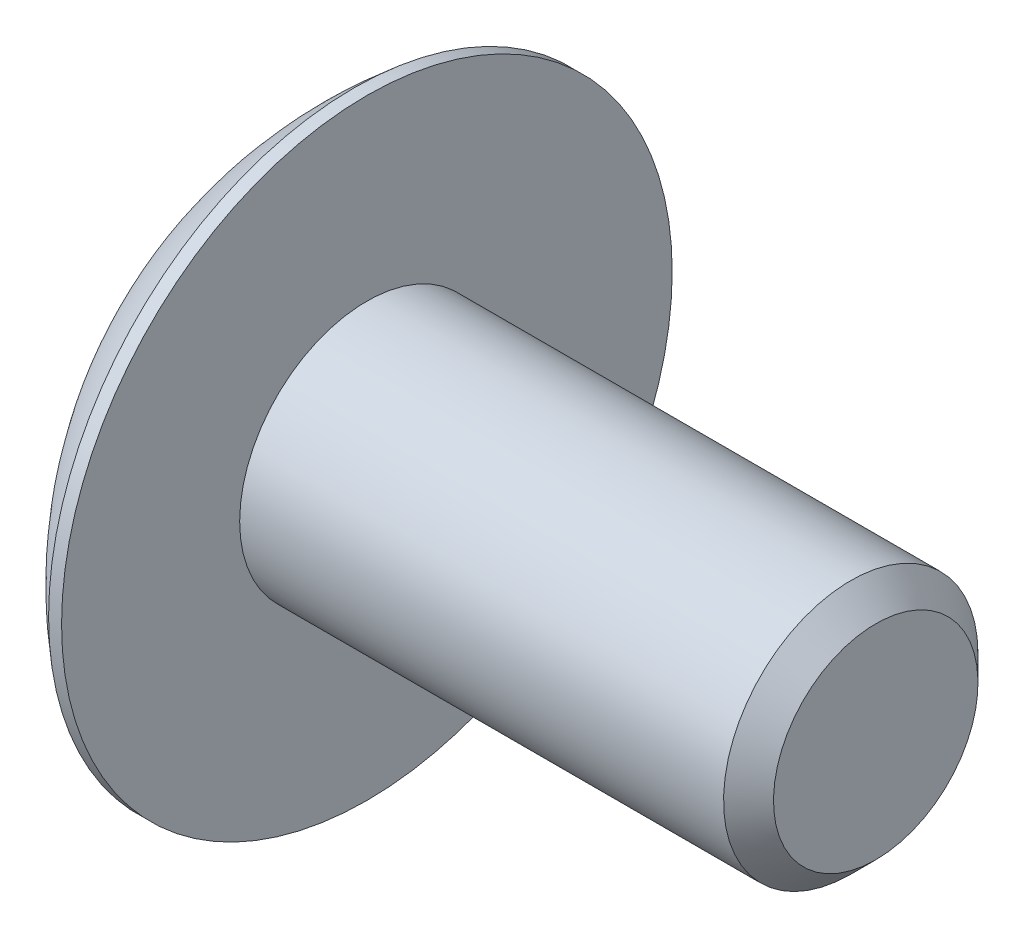
ISO-10303-21;
HEADER;
FILE_DESCRIPTION(('STEP AP214'),'2;1');
FILE_NAME('part.step','',(''),(''),'','','');
FILE_SCHEMA(('AUTOMOTIVE_DESIGN { 1 0 10303 214 1 1 1 1 }'));
ENDSEC;
DATA;
#1=APPLICATION_CONTEXT('core data for automotive mechanical design processes');
#2=APPLICATION_PROTOCOL_DEFINITION('international standard','automotive_design',2000,#1);
#3=PRODUCT_CONTEXT('',#1,'mechanical');
#4=PRODUCT('Part','Part','',(#3));
#5=PRODUCT_RELATED_PRODUCT_CATEGORY('part','',(#4));
#6=PRODUCT_DEFINITION_FORMATION('','',#4);
#7=PRODUCT_DEFINITION_CONTEXT('part definition',#1,'design');
#8=PRODUCT_DEFINITION('design','',#6,#7);
#9=PRODUCT_DEFINITION_SHAPE('','',#8);
#10=(LENGTH_UNIT() NAMED_UNIT(*) SI_UNIT(.MILLI.,.METRE.));
#11=(NAMED_UNIT(*) PLANE_ANGLE_UNIT() SI_UNIT($,.RADIAN.));
#12=(NAMED_UNIT(*) SI_UNIT($,.STERADIAN.) SOLID_ANGLE_UNIT());
#13=UNCERTAINTY_MEASURE_WITH_UNIT(LENGTH_MEASURE(1.E-05),#10,'distance_accuracy_value','');
#14=(GEOMETRIC_REPRESENTATION_CONTEXT(3) GLOBAL_UNCERTAINTY_ASSIGNED_CONTEXT((#13)) GLOBAL_UNIT_ASSIGNED_CONTEXT((#10,
#11,#12)) REPRESENTATION_CONTEXT('',''));
#15=CARTESIAN_POINT('',(0.,0.,0.));
#16=DIRECTION('',(0.,0.,1.));
#17=DIRECTION('',(1.,0.,0.));
#18=AXIS2_PLACEMENT_3D('',#15,#16,#17);
#19=CARTESIAN_POINT('',(10.,-2.033614,2.033614));
#20=DIRECTION('',(1.,0.,0.));
#21=DIRECTION('',(0.,0.,-1.));
#22=AXIS2_PLACEMENT_3D('',#19,#20,#21);
#23=PLANE('',#22);
#24=CARTESIAN_POINT('',(10.,0.,0.));
#25=DIRECTION('',(-1.,0.,0.));
#26=DIRECTION('',(0.,-1.,0.));
#27=AXIS2_PLACEMENT_3D('',#24,#25,#26);
#28=CIRCLE('',#27,2.0095);
#29=CARTESIAN_POINT('',(10.,-2.0095,0.));
#30=VERTEX_POINT('',#29);
#31=EDGE_CURVE('E18',#30,#30,#28,.T.);
#32=ORIENTED_EDGE('',*,*,#31,.F.);
#33=EDGE_LOOP('',(#32));
#34=FACE_BOUND('',#33,.T.);
#35=ADVANCED_FACE('F15',(#34),#23,.T.);
#36=CARTESIAN_POINT('',(10.,0.,0.));
#37=DIRECTION('',(-1.,0.,0.));
#38=DIRECTION('',(0.,-1.,0.));
#39=AXIS2_PLACEMENT_3D('',#36,#37,#38);
#40=CONICAL_SURFACE('',#39,2.0095,0.785398163397449);
#41=CARTESIAN_POINT('',(9.5095,0.,0.));
#42=DIRECTION('',(1.,0.,0.));
#43=DIRECTION('',(0.,0.,-1.));
#44=AXIS2_PLACEMENT_3D('',#41,#42,#43);
#45=CIRCLE('',#44,2.5);
#46=CARTESIAN_POINT('',(9.5095,0.,-2.5));
#47=VERTEX_POINT('',#46);
#48=EDGE_CURVE('E165',#47,#47,#45,.F.);
#49=ORIENTED_EDGE('',*,*,#48,.F.);
#50=EDGE_LOOP('',(#49));
#51=FACE_BOUND('',#50,.T.);
#52=ORIENTED_EDGE('',*,*,#31,.T.);
#53=EDGE_LOOP('',(#52));
#54=FACE_BOUND('',#53,.T.);
#55=ADVANCED_FACE('F295',(#51,#54),#40,.T.);
#56=CARTESIAN_POINT('',(9.5095,0.,0.));
#57=DIRECTION('',(1.,0.,0.));
#58=DIRECTION('',(0.,0.,-1.));
#59=AXIS2_PLACEMENT_3D('',#56,#57,#58);
#60=CYLINDRICAL_SURFACE('',#59,2.5);
#61=ORIENTED_EDGE('',*,*,#48,.T.);
#62=EDGE_LOOP('',(#61));
#63=FACE_BOUND('',#62,.T.);
#64=CARTESIAN_POINT('',(0.,0.,0.));
#65=DIRECTION('',(1.,0.,0.));
#66=DIRECTION('',(0.,0.,-1.));
#67=AXIS2_PLACEMENT_3D('',#64,#65,#66);
#68=CIRCLE('',#67,2.5);
#69=CARTESIAN_POINT('',(0.,0.,-2.5));
#70=VERTEX_POINT('',#69);
#71=EDGE_CURVE('E118',#70,#70,#68,.F.);
#72=ORIENTED_EDGE('',*,*,#71,.F.);
#73=EDGE_LOOP('',(#72));
#74=FACE_BOUND('',#73,.T.);
#75=ADVANCED_FACE('F292',(#63,#74),#60,.T.);
#76=CARTESIAN_POINT('',(0.,-6.07200000000001,6.072));
#77=DIRECTION('',(1.,0.,0.));
#78=DIRECTION('',(0.,0.,-1.));
#79=AXIS2_PLACEMENT_3D('',#76,#77,#78);
#80=PLANE('',#79);
#81=ORIENTED_EDGE('',*,*,#71,.T.);
#82=EDGE_LOOP('',(#81));
#83=FACE_BOUND('',#82,.T.);
#84=CARTESIAN_POINT('',(0.,0.,0.));
#85=DIRECTION('',(1.,0.,0.));
#86=DIRECTION('',(0.,0.,-1.));
#87=AXIS2_PLACEMENT_3D('',#84,#85,#86);
#88=CIRCLE('',#87,6.);
#89=CARTESIAN_POINT('',(0.,0.,-6.));
#90=VERTEX_POINT('',#89);
#91=EDGE_CURVE('E117',#90,#90,#88,.F.);
#92=ORIENTED_EDGE('',*,*,#91,.F.);
#93=EDGE_LOOP('',(#92));
#94=FACE_BOUND('',#93,.T.);
#95=ADVANCED_FACE('F289',(#83,#94),#80,.T.);
#96=CARTESIAN_POINT('',(-1.55,-2.48,-2.48));
#97=DIRECTION('',(-1.,0.,0.));
#98=DIRECTION('',(0.,0.,1.));
#99=AXIS2_PLACEMENT_3D('',#96,#97,#98);
#100=PLANE('',#99);
#101=DIRECTION('',(0.,0.,-1.));
#102=VECTOR('',#101,1.);
#103=CARTESIAN_POINT('',(-1.55,-0.62,1.55));
#104=LINE('',#103,#102);
#105=CARTESIAN_POINT('',(-1.55,-0.62,2.48));
#106=VERTEX_POINT('',#105);
#107=CARTESIAN_POINT('',(-1.55,-0.62,0.62));
#108=VERTEX_POINT('',#107);
#109=EDGE_CURVE('E155',#106,#108,#104,.T.);
#110=ORIENTED_EDGE('',*,*,#109,.F.);
#111=DIRECTION('',(0.,1.,0.));
#112=VECTOR('',#111,1.);
#113=CARTESIAN_POINT('',(-1.55,-0.62,2.48));
#114=LINE('',#113,#112);
#115=CARTESIAN_POINT('',(-1.55,0.62,2.48));
#116=VERTEX_POINT('',#115);
#117=EDGE_CURVE('E158',#116,#106,#114,.F.);
#118=ORIENTED_EDGE('',*,*,#117,.F.);
#119=DIRECTION('',(0.,0.,1.));
#120=VECTOR('',#119,1.);
#121=CARTESIAN_POINT('',(-1.55,0.62,1.55));
#122=LINE('',#121,#120);
#123=CARTESIAN_POINT('',(-1.55,0.62,0.62));
#124=VERTEX_POINT('',#123);
#125=EDGE_CURVE('E161',#124,#116,#122,.T.);
#126=ORIENTED_EDGE('',*,*,#125,.F.);
#127=DIRECTION('',(0.,1.,0.));
#128=VECTOR('',#127,1.);
#129=CARTESIAN_POINT('',(-1.55,0.62,0.62));
#130=LINE('',#129,#128);
#131=CARTESIAN_POINT('',(-1.55,2.48,0.62));
#132=VERTEX_POINT('',#131);
#133=EDGE_CURVE('E125',#132,#124,#130,.F.);
#134=ORIENTED_EDGE('',*,*,#133,.F.);
#135=DIRECTION('',(0.,0.,1.));
#136=VECTOR('',#135,1.);
#137=CARTESIAN_POINT('',(-1.55,2.48,0.));
#138=LINE('',#137,#136);
#139=CARTESIAN_POINT('',(-1.55,2.48,-0.62));
#140=VERTEX_POINT('',#139);
#141=EDGE_CURVE('E121',#140,#132,#138,.T.);
#142=ORIENTED_EDGE('',*,*,#141,.F.);
#143=DIRECTION('',(0.,1.,0.));
#144=VECTOR('',#143,1.);
#145=CARTESIAN_POINT('',(-1.55,0.62,-0.62));
#146=LINE('',#145,#144);
#147=CARTESIAN_POINT('',(-1.55,0.62,-0.62));
#148=VERTEX_POINT('',#147);
#149=EDGE_CURVE('E78',#148,#140,#146,.T.);
#150=ORIENTED_EDGE('',*,*,#149,.F.);
#151=DIRECTION('',(0.,0.,1.));
#152=VECTOR('',#151,1.);
#153=CARTESIAN_POINT('',(-1.55,0.62,-1.55));
#154=LINE('',#153,#152);
#155=CARTESIAN_POINT('',(-1.55,0.62,-2.48));
#156=VERTEX_POINT('',#155);
#157=EDGE_CURVE('E139',#156,#148,#154,.T.);
#158=ORIENTED_EDGE('',*,*,#157,.F.);
#159=DIRECTION('',(0.,1.,0.));
#160=VECTOR('',#159,1.);
#161=CARTESIAN_POINT('',(-1.55,-0.62,-2.48));
#162=LINE('',#161,#160);
#163=CARTESIAN_POINT('',(-1.55,-0.62,-2.48));
#164=VERTEX_POINT('',#163);
#165=EDGE_CURVE('E83',#164,#156,#162,.T.);
#166=ORIENTED_EDGE('',*,*,#165,.F.);
#167=DIRECTION('',(0.,0.,-1.));
#168=VECTOR('',#167,1.);
#169=CARTESIAN_POINT('',(-1.55,-0.62,-1.55));
#170=LINE('',#169,#168);
#171=CARTESIAN_POINT('',(-1.55,-0.62,-0.62));
#172=VERTEX_POINT('',#171);
#173=EDGE_CURVE('E143',#172,#164,#170,.T.);
#174=ORIENTED_EDGE('',*,*,#173,.F.);
#175=DIRECTION('',(0.,1.,0.));
#176=VECTOR('',#175,1.);
#177=CARTESIAN_POINT('',(-1.55,-2.48,-0.62));
#178=LINE('',#177,#176);
#179=CARTESIAN_POINT('',(-1.55,-2.48,-0.62));
#180=VERTEX_POINT('',#179);
#181=EDGE_CURVE('E146',#180,#172,#178,.T.);
#182=ORIENTED_EDGE('',*,*,#181,.F.);
#183=DIRECTION('',(0.,0.,-1.));
#184=VECTOR('',#183,1.);
#185=CARTESIAN_POINT('',(-1.55,-2.48,0.));
#186=LINE('',#185,#184);
#187=CARTESIAN_POINT('',(-1.55,-2.48,0.62));
#188=VERTEX_POINT('',#187);
#189=EDGE_CURVE('E149',#188,#180,#186,.T.);
#190=ORIENTED_EDGE('',*,*,#189,.F.);
#191=DIRECTION('',(0.,1.,0.));
#192=VECTOR('',#191,1.);
#193=CARTESIAN_POINT('',(-1.55,-2.48,0.62));
#194=LINE('',#193,#192);
#195=EDGE_CURVE('E152',#108,#188,#194,.F.);
#196=ORIENTED_EDGE('',*,*,#195,.F.);
#197=EDGE_LOOP('',(#110,#118,#126,#134,#142,#150,#158,#166,#174,#182,#190,#196));
#198=FACE_BOUND('',#197,.T.);
#199=ADVANCED_FACE('F123',(#198),#100,.T.);
#200=CARTESIAN_POINT('',(-3.05924169752797,0.62,-0.62));
#201=DIRECTION('',(0.,0.,1.));
#202=DIRECTION('',(1.,0.,0.));
#203=AXIS2_PLACEMENT_3D('',#200,#201,#202);
#204=PLANE('',#203);
#205=DIRECTION('',(1.,0.,0.));
#206=VECTOR('',#205,1.);
#207=CARTESIAN_POINT('',(-2.699340870773,2.48,-0.62));
#208=LINE('',#207,#206);
#209=CARTESIAN_POINT('',(-2.66626270714769,2.48,-0.620000000000003));
#210=VERTEX_POINT('',#209);
#211=EDGE_CURVE('E113',#210,#140,#208,.T.);
#212=ORIENTED_EDGE('',*,*,#211,.F.);
#213=CARTESIAN_POINT('',(-3.05024025599203,0.620000000000015,-0.620000000000001));
#214=CARTESIAN_POINT('',(-3.03976785253531,0.750042430570017,-0.620000000000001));
#215=CARTESIAN_POINT('',(-3.02600570245601,0.879791187471085,-0.62));
#216=CARTESIAN_POINT('',(-2.99192929742701,1.13844253143422,-0.62));
#217=CARTESIAN_POINT('',(-2.97161419096447,1.26734500630525,-0.62));
#218=CARTESIAN_POINT('',(-2.90119534299645,1.65065962618764,-0.62));
#219=CARTESIAN_POINT('',(-2.84147927553657,1.90339315228961,-0.62));
#220=CARTESIAN_POINT('',(-2.73735262943617,2.2623658375459,-0.62));
#221=CARTESIAN_POINT('',(-2.70301225175608,2.37161122534369,-0.62));
#222=CARTESIAN_POINT('',(-2.66626270714769,2.48000000000001,-0.62));
#223=B_SPLINE_CURVE_WITH_KNOTS('',3,(#213,#214,#215,#216,#217,#218,#219,#220,#221,#222),
.UNSPECIFIED.,.F.,.F.,(4,2,2,2,4),(0.,0.391291116744801,0.782633099649313,1.56018065414437,
1.90359581219608),.UNSPECIFIED.);
#224=CARTESIAN_POINT('',(-3.05024025599202,0.620000000000008,-0.620000000000001));
#225=VERTEX_POINT('',#224);
#226=EDGE_CURVE('E70',#225,#210,#223,.T.);
#227=ORIENTED_EDGE('',*,*,#226,.F.);
#228=DIRECTION('',(1.,0.,0.));
#229=VECTOR('',#228,1.);
#230=CARTESIAN_POINT('',(-3.05924169752797,0.62,-0.62));
#231=LINE('',#230,#229);
#232=EDGE_CURVE('E115',#148,#225,#231,.F.);
#233=ORIENTED_EDGE('',*,*,#232,.F.);
#234=ORIENTED_EDGE('',*,*,#149,.T.);
#235=EDGE_LOOP('',(#212,#227,#233,#234));
#236=FACE_BOUND('',#235,.T.);
#237=ADVANCED_FACE('F111',(#236),#204,.T.);
#238=CARTESIAN_POINT('',(0.,0.,0.));
#239=DIRECTION('',(1.,0.,0.));
#240=DIRECTION('',(0.,0.,-1.));
#241=AXIS2_PLACEMENT_3D('',#238,#239,#240);
#242=CYLINDRICAL_SURFACE('',#241,6.);
#243=ORIENTED_EDGE('',*,*,#91,.T.);
#244=EDGE_LOOP('',(#243));
#245=FACE_BOUND('',#244,.T.);
#246=CARTESIAN_POINT('',(-0.25535421758717,0.,0.));
#247=DIRECTION('',(1.,0.,0.));
#248=DIRECTION('',(0.,1.,0.));
#249=AXIS2_PLACEMENT_3D('',#246,#247,#248);
#250=CIRCLE('',#249,5.99999999999999);
#251=CARTESIAN_POINT('',(-0.25535421758717,5.99999999999999,0.));
#252=VERTEX_POINT('',#251);
#253=EDGE_CURVE('E280',#252,#252,#250,.F.);
#254=ORIENTED_EDGE('',*,*,#253,.F.);
#255=EDGE_LOOP('',(#254));
#256=FACE_BOUND('',#255,.T.);
#257=ADVANCED_FACE('F274',(#245,#256),#242,.T.);
#258=CARTESIAN_POINT('',(-2.699340870773,2.48,0.62));
#259=DIRECTION('',(0.,-1.,0.));
#260=DIRECTION('',(0.,0.,-1.));
#261=AXIS2_PLACEMENT_3D('',#258,#259,#260);
#262=PLANE('',#261);
#263=DIRECTION('',(1.,0.,0.));
#264=VECTOR('',#263,1.);
#265=CARTESIAN_POINT('',(-2.30462084876399,2.48,0.62));
#266=LINE('',#265,#264);
#267=CARTESIAN_POINT('',(-2.66626270714769,2.48000000000001,0.62));
#268=VERTEX_POINT('',#267);
#269=EDGE_CURVE('E129',#268,#132,#266,.T.);
#270=ORIENTED_EDGE('',*,*,#269,.F.);
#271=CARTESIAN_POINT('',(-2.6662627071477,2.48,-0.620000000000006));
#272=CARTESIAN_POINT('',(-2.68374487241107,2.48,-0.413333333333334));
#273=CARTESIAN_POINT('',(-2.69248595504276,2.48,-0.206666666666663));
#274=CARTESIAN_POINT('',(-2.69248595504276,2.48,0.206666666666672));
#275=CARTESIAN_POINT('',(-2.68374487241107,2.48,0.413333333333335));
#276=CARTESIAN_POINT('',(-2.6662627071477,2.48,0.619999999999998));
#277=B_SPLINE_CURVE_WITH_KNOTS('',3,(#271,#272,#273,#274,#275,#276),.UNSPECIFIED.,.F.,.F.,(4,2,
4),(0.,0.620554315697009,1.24110863139399),.UNSPECIFIED.);
#278=EDGE_CURVE('E132',#210,#268,#277,.T.);
#279=ORIENTED_EDGE('',*,*,#278,.F.);
#280=ORIENTED_EDGE('',*,*,#211,.T.);
#281=ORIENTED_EDGE('',*,*,#141,.T.);
#282=EDGE_LOOP('',(#270,#279,#280,#281));
#283=FACE_BOUND('',#282,.T.);
#284=ADVANCED_FACE('F131',(#283),#262,.T.);
#285=CARTESIAN_POINT('',(-1.55,0.62,0.62));
#286=DIRECTION('',(0.,0.,-1.));
#287=DIRECTION('',(-1.,0.,0.));
#288=AXIS2_PLACEMENT_3D('',#285,#286,#287);
#289=PLANE('',#288);
#290=DIRECTION('',(1.,0.,0.));
#291=VECTOR('',#290,1.);
#292=CARTESIAN_POINT('',(-3.05924169752797,0.62,0.62));
#293=LINE('',#292,#291);
#294=CARTESIAN_POINT('',(-3.05024025599202,0.620000000000001,0.620000000000008));
#295=VERTEX_POINT('',#294);
#296=EDGE_CURVE('E163',#295,#124,#293,.T.);
#297=ORIENTED_EDGE('',*,*,#296,.F.);
#298=CARTESIAN_POINT('',(-2.66626270714769,2.48000000000002,0.62));
#299=CARTESIAN_POINT('',(-2.69181640713699,2.40461518803386,0.62));
#300=CARTESIAN_POINT('',(-2.71620419200081,2.32883520125785,0.62));
#301=CARTESIAN_POINT('',(-2.76256054766245,2.17677383977463,0.62));
#302=CARTESIAN_POINT('',(-2.78453578607209,2.10049449766565,0.62));
#303=CARTESIAN_POINT('',(-2.82608557115019,1.94743963746694,0.62));
#304=CARTESIAN_POINT('',(-2.84566457906741,1.870665330453,0.62));
#305=CARTESIAN_POINT('',(-2.88243428856193,1.71662395682747,0.62));
#306=CARTESIAN_POINT('',(-2.8996272398254,1.63935742720947,0.62));
#307=CARTESIAN_POINT('',(-2.93163051496762,1.48433249946647,0.62));
#308=CARTESIAN_POINT('',(-2.94644083884637,1.40657410134147,0.62));
#309=CARTESIAN_POINT('',(-2.97367784849535,1.2505648015221,0.62));
#310=CARTESIAN_POINT('',(-2.98610225584174,1.17231350204033,0.62));
#311=CARTESIAN_POINT('',(-3.0085593020508,1.01531714556654,0.62));
#312=CARTESIAN_POINT('',(-3.0185873647853,0.936571433978338,0.62));
#313=CARTESIAN_POINT('',(-3.03623735234413,0.778583943000307,0.62));
#314=CARTESIAN_POINT('',(-3.04385234972373,0.69934138965147,0.62));
#315=CARTESIAN_POINT('',(-3.05024025599203,0.620000000000012,0.619999999999999));
#316=B_SPLINE_CURVE_WITH_KNOTS('',3,(#298,#299,#300,#301,#302,#303,#304,#305,#306,#307,#308,
#309,#310,#311,#312,#313,#314,#315),.UNSPECIFIED.,.F.,.F.,(4,2,2,2,2,2,2,2,4),(0.,
0.238784796436356,0.476892098817798,0.714549127805248,0.951980537755309,1.18941194770537,
1.42706897669282,1.66517627907426,1.90396107551062),.UNSPECIFIED.);
#317=EDGE_CURVE('E256',#268,#295,#316,.T.);
#318=ORIENTED_EDGE('',*,*,#317,.F.);
#319=ORIENTED_EDGE('',*,*,#269,.T.);
#320=ORIENTED_EDGE('',*,*,#133,.T.);
#321=EDGE_LOOP('',(#297,#318,#319,#320));
#322=FACE_BOUND('',#321,.T.);
#323=ADVANCED_FACE('F265',(#322),#289,.T.);
#324=CARTESIAN_POINT('',(-3.05924169752797,0.62,2.48));
#325=DIRECTION('',(0.,-1.,0.));
#326=DIRECTION('',(0.,0.,-1.));
#327=AXIS2_PLACEMENT_3D('',#324,#325,#326);
#328=PLANE('',#327);
#329=DIRECTION('',(1.,0.,0.));
#330=VECTOR('',#329,1.);
#331=CARTESIAN_POINT('',(-2.12467043538651,0.62,2.48));
#332=LINE('',#331,#330);
#333=CARTESIAN_POINT('',(-2.66626270714769,0.620000000000004,2.48));
#334=VERTEX_POINT('',#333);
#335=EDGE_CURVE('E160',#334,#116,#332,.T.);
#336=ORIENTED_EDGE('',*,*,#335,.F.);
#337=CARTESIAN_POINT('',(-3.05024025599203,0.620000000000001,0.620000000000015));
#338=CARTESIAN_POINT('',(-3.03976785253531,0.620000000000001,0.750042430570017));
#339=CARTESIAN_POINT('',(-3.02600570245601,0.62,0.879791187471085));
#340=CARTESIAN_POINT('',(-2.99192929742701,0.62,1.13844253143422));
#341=CARTESIAN_POINT('',(-2.97161419096447,0.62,1.26734500630525));
#342=CARTESIAN_POINT('',(-2.90119534299645,0.62,1.65065962618764));
#343=CARTESIAN_POINT('',(-2.84147927553657,0.62,1.90339315228961));
#344=CARTESIAN_POINT('',(-2.73735262943617,0.62,2.2623658375459));
#345=CARTESIAN_POINT('',(-2.70301225175608,0.62,2.37161122534369));
#346=CARTESIAN_POINT('',(-2.66626270714769,0.62,2.48000000000001));
#347=B_SPLINE_CURVE_WITH_KNOTS('',3,(#337,#338,#339,#340,#341,#342,#343,#344,#345,#346),
.UNSPECIFIED.,.F.,.F.,(4,2,2,2,4),(0.,0.391291116744801,0.782633099649313,1.56018065414437,
1.90359581219608),.UNSPECIFIED.);
#348=EDGE_CURVE('E250',#295,#334,#347,.T.);
#349=ORIENTED_EDGE('',*,*,#348,.F.);
#350=ORIENTED_EDGE('',*,*,#296,.T.);
#351=ORIENTED_EDGE('',*,*,#125,.T.);
#352=EDGE_LOOP('',(#336,#349,#350,#351));
#353=FACE_BOUND('',#352,.T.);
#354=ADVANCED_FACE('F262',(#353),#328,.T.);
#355=CARTESIAN_POINT('',(-1.55,-0.62,2.48));
#356=DIRECTION('',(0.,0.,-1.));
#357=DIRECTION('',(-1.,0.,0.));
#358=AXIS2_PLACEMENT_3D('',#355,#356,#357);
#359=PLANE('',#358);
#360=DIRECTION('',(1.,0.,0.));
#361=VECTOR('',#360,1.);
#362=CARTESIAN_POINT('',(-3.05924169752797,-0.62,2.48));
#363=LINE('',#362,#361);
#364=CARTESIAN_POINT('',(-2.66626270714769,-0.62,2.48000000000001));
#365=VERTEX_POINT('',#364);
#366=EDGE_CURVE('E157',#365,#106,#363,.T.);
#367=ORIENTED_EDGE('',*,*,#366,.F.);
#368=CARTESIAN_POINT('',(-2.6662627071477,0.620000000000007,2.48));
#369=CARTESIAN_POINT('',(-2.68374487241118,0.413333333333339,2.48));
#370=CARTESIAN_POINT('',(-2.69248595504292,0.206666666666671,2.48));
#371=CARTESIAN_POINT('',(-2.69248595504292,-0.206666666666666,2.48));
#372=CARTESIAN_POINT('',(-2.68374487241118,-0.413333333333335,2.48));
#373=CARTESIAN_POINT('',(-2.6662627071477,-0.620000000000003,2.48));
#374=B_SPLINE_CURVE_WITH_KNOTS('',3,(#368,#369,#370,#371,#372,#373),.UNSPECIFIED.,.F.,.F.,(4,2,
4),(0.,0.620554315697007,1.24110863139401),.UNSPECIFIED.);
#375=EDGE_CURVE('E244',#334,#365,#374,.T.);
#376=ORIENTED_EDGE('',*,*,#375,.F.);
#377=ORIENTED_EDGE('',*,*,#335,.T.);
#378=ORIENTED_EDGE('',*,*,#117,.T.);
#379=EDGE_LOOP('',(#367,#376,#377,#378));
#380=FACE_BOUND('',#379,.T.);
#381=ADVANCED_FACE('F234',(#380),#359,.T.);
#382=CARTESIAN_POINT('',(-3.05924169752797,-0.62,0.62));
#383=DIRECTION('',(0.,1.,0.));
#384=DIRECTION('',(0.,0.,1.));
#385=AXIS2_PLACEMENT_3D('',#382,#383,#384);
#386=PLANE('',#385);
#387=DIRECTION('',(1.,0.,0.));
#388=VECTOR('',#387,1.);
#389=CARTESIAN_POINT('',(-2.30462084876399,-0.62,0.62));
#390=LINE('',#389,#388);
#391=CARTESIAN_POINT('',(-3.05024025599202,-0.620000000000003,0.620000000000001));
#392=VERTEX_POINT('',#391);
#393=EDGE_CURVE('E154',#392,#108,#390,.T.);
#394=ORIENTED_EDGE('',*,*,#393,.F.);
#395=CARTESIAN_POINT('',(-2.66626270714769,-0.62,2.48000000000002));
#396=CARTESIAN_POINT('',(-2.691816407137,-0.62,2.40461518803385));
#397=CARTESIAN_POINT('',(-2.71620419200081,-0.62,2.32883520125785));
#398=CARTESIAN_POINT('',(-2.76256054766245,-0.62,2.17677383977463));
#399=CARTESIAN_POINT('',(-2.78453578607209,-0.62,2.10049449766564));
#400=CARTESIAN_POINT('',(-2.82608557115019,-0.62,1.94743963746693));
#401=CARTESIAN_POINT('',(-2.84566457906741,-0.62,1.87066533045299));
#402=CARTESIAN_POINT('',(-2.88243428856193,-0.62,1.71662395682746));
#403=CARTESIAN_POINT('',(-2.8996272398254,-0.62,1.63935742720946));
#404=CARTESIAN_POINT('',(-2.93163051496762,-0.62,1.48433249946645));
#405=CARTESIAN_POINT('',(-2.94644083884637,-0.62,1.40657410134146));
#406=CARTESIAN_POINT('',(-2.97367784849535,-0.62,1.25056480152209));
#407=CARTESIAN_POINT('',(-2.98610225584174,-0.62,1.17231350204032));
#408=CARTESIAN_POINT('',(-3.0085593020508,-0.62,1.01531714556653));
#409=CARTESIAN_POINT('',(-3.01858736478531,-0.62,0.93657143397832));
#410=CARTESIAN_POINT('',(-3.03623735234413,-0.62,0.778583943000288));
#411=CARTESIAN_POINT('',(-3.04385234972374,-0.62,0.699341389651451));
#412=CARTESIAN_POINT('',(-3.05024025599203,-0.62,0.619999999999992));
#413=B_SPLINE_CURVE_WITH_KNOTS('',3,(#395,#396,#397,#398,#399,#400,#401,#402,#403,#404,#405,
#406,#407,#408,#409,#410,#411,#412),.UNSPECIFIED.,.F.,.F.,(4,2,2,2,2,2,2,2,4),(0.,
0.238784796436358,0.476892098817802,0.714549127805254,0.951980537755317,1.18941194770538,
1.42706897669283,1.66517627907428,1.90396107551063),.UNSPECIFIED.);
#414=EDGE_CURVE('E238',#365,#392,#413,.T.);
#415=ORIENTED_EDGE('',*,*,#414,.F.);
#416=ORIENTED_EDGE('',*,*,#366,.T.);
#417=ORIENTED_EDGE('',*,*,#109,.T.);
#418=EDGE_LOOP('',(#394,#415,#416,#417));
#419=FACE_BOUND('',#418,.T.);
#420=ADVANCED_FACE('F229',(#419),#386,.T.);
#421=CARTESIAN_POINT('',(-1.55,-2.48,0.62));
#422=DIRECTION('',(0.,0.,-1.));
#423=DIRECTION('',(-1.,0.,0.));
#424=AXIS2_PLACEMENT_3D('',#421,#422,#423);
#425=PLANE('',#424);
#426=DIRECTION('',(1.,0.,0.));
#427=VECTOR('',#426,1.);
#428=CARTESIAN_POINT('',(-2.69934087077301,-2.48,0.62));
#429=LINE('',#428,#427);
#430=CARTESIAN_POINT('',(-2.66626270714769,-2.48,0.620000000000002));
#431=VERTEX_POINT('',#430);
#432=EDGE_CURVE('E151',#431,#188,#429,.T.);
#433=ORIENTED_EDGE('',*,*,#432,.F.);
#434=CARTESIAN_POINT('',(-3.05024025599203,-0.620000000000006,0.620000000000001));
#435=CARTESIAN_POINT('',(-3.03976785253531,-0.750042430570007,0.620000000000001));
#436=CARTESIAN_POINT('',(-3.02600570245601,-0.879791187471075,0.62));
#437=CARTESIAN_POINT('',(-2.99192929742701,-1.13844253143421,0.62));
#438=CARTESIAN_POINT('',(-2.97161419096447,-1.26734500630524,0.62));
#439=CARTESIAN_POINT('',(-2.90119534299645,-1.65065962618763,0.62));
#440=CARTESIAN_POINT('',(-2.84147927553657,-1.9033931522896,0.62));
#441=CARTESIAN_POINT('',(-2.73735262943617,-2.2623658375459,0.62));
#442=CARTESIAN_POINT('',(-2.70301225175608,-2.37161122534369,0.62));
#443=CARTESIAN_POINT('',(-2.66626270714769,-2.48000000000002,0.62));
#444=B_SPLINE_CURVE_WITH_KNOTS('',3,(#434,#435,#436,#437,#438,#439,#440,#441,#442,#443),
.UNSPECIFIED.,.F.,.F.,(4,2,2,2,4),(0.,0.3912911167448,0.782633099649313,1.56018065414437,
1.90359581219609),.UNSPECIFIED.);
#445=EDGE_CURVE('E215',#392,#431,#444,.T.);
#446=ORIENTED_EDGE('',*,*,#445,.F.);
#447=ORIENTED_EDGE('',*,*,#393,.T.);
#448=ORIENTED_EDGE('',*,*,#195,.T.);
#449=EDGE_LOOP('',(#433,#446,#447,#448));
#450=FACE_BOUND('',#449,.T.);
#451=ADVANCED_FACE('F224',(#450),#425,.T.);
#452=CARTESIAN_POINT('',(-2.6993881479629,-2.48,-0.62));
#453=DIRECTION('',(0.,1.,0.));
#454=DIRECTION('',(0.,0.,1.));
#455=AXIS2_PLACEMENT_3D('',#452,#453,#454);
#456=PLANE('',#455);
#457=DIRECTION('',(1.,0.,0.));
#458=VECTOR('',#457,1.);
#459=CARTESIAN_POINT('',(-2.30462084876399,-2.48,-0.62));
#460=LINE('',#459,#458);
#461=CARTESIAN_POINT('',(-2.66626270714769,-2.48000000000001,-0.62));
#462=VERTEX_POINT('',#461);
#463=EDGE_CURVE('E148',#462,#180,#460,.T.);
#464=ORIENTED_EDGE('',*,*,#463,.F.);
#465=CARTESIAN_POINT('',(-2.6662627071477,-2.48,0.620000000000003));
#466=CARTESIAN_POINT('',(-2.68374487241118,-2.48,0.413333333333334));
#467=CARTESIAN_POINT('',(-2.69248595504292,-2.48,0.206666666666666));
#468=CARTESIAN_POINT('',(-2.69248595504292,-2.48,-0.206666666666671));
#469=CARTESIAN_POINT('',(-2.68374487241118,-2.48,-0.413333333333339));
#470=CARTESIAN_POINT('',(-2.6662627071477,-2.48,-0.620000000000008));
#471=B_SPLINE_CURVE_WITH_KNOTS('',3,(#465,#466,#467,#468,#469,#470),.UNSPECIFIED.,.F.,.F.,(4,2,
4),(0.,0.620554315697007,1.24110863139401),.UNSPECIFIED.);
#472=EDGE_CURVE('E209',#431,#462,#471,.T.);
#473=ORIENTED_EDGE('',*,*,#472,.F.);
#474=ORIENTED_EDGE('',*,*,#432,.T.);
#475=ORIENTED_EDGE('',*,*,#189,.T.);
#476=EDGE_LOOP('',(#464,#473,#474,#475));
#477=FACE_BOUND('',#476,.T.);
#478=ADVANCED_FACE('F221',(#477),#456,.T.);
#479=CARTESIAN_POINT('',(-3.05924169752797,-2.48,-0.62));
#480=DIRECTION('',(0.,0.,1.));
#481=DIRECTION('',(1.,0.,0.));
#482=AXIS2_PLACEMENT_3D('',#479,#480,#481);
#483=PLANE('',#482);
#484=DIRECTION('',(1.,0.,0.));
#485=VECTOR('',#484,1.);
#486=CARTESIAN_POINT('',(-3.05924169752797,-0.62,-0.62));
#487=LINE('',#486,#485);
#488=CARTESIAN_POINT('',(-3.05024025599202,-0.619999999999999,-0.620000000000006));
#489=VERTEX_POINT('',#488);
#490=EDGE_CURVE('E145',#489,#172,#487,.T.);
#491=ORIENTED_EDGE('',*,*,#490,.F.);
#492=CARTESIAN_POINT('',(-2.66626270714769,-2.48000000000002,-0.62));
#493=CARTESIAN_POINT('',(-2.691816407137,-2.40461518803385,-0.62));
#494=CARTESIAN_POINT('',(-2.71620419200081,-2.32883520125785,-0.62));
#495=CARTESIAN_POINT('',(-2.76256054766245,-2.17677383977463,-0.62));
#496=CARTESIAN_POINT('',(-2.78453578607209,-2.10049449766565,-0.62));
#497=CARTESIAN_POINT('',(-2.82608557115019,-1.94743963746694,-0.62));
#498=CARTESIAN_POINT('',(-2.84566457906741,-1.87066533045299,-0.62));
#499=CARTESIAN_POINT('',(-2.88243428856193,-1.71662395682747,-0.62));
#500=CARTESIAN_POINT('',(-2.8996272398254,-1.63935742720947,-0.62));
#501=CARTESIAN_POINT('',(-2.93163051496762,-1.48433249946647,-0.62));
#502=CARTESIAN_POINT('',(-2.94644083884637,-1.40657410134147,-0.62));
#503=CARTESIAN_POINT('',(-2.97367784849535,-1.2505648015221,-0.62));
#504=CARTESIAN_POINT('',(-2.98610225584174,-1.17231350204034,-0.62));
#505=CARTESIAN_POINT('',(-3.0085593020508,-1.01531714556655,-0.62));
#506=CARTESIAN_POINT('',(-3.0185873647853,-0.93657143397834,-0.62));
#507=CARTESIAN_POINT('',(-3.03623735234413,-0.77858394300031,-0.62));
#508=CARTESIAN_POINT('',(-3.04385234972373,-0.699341389651474,-0.62));
#509=CARTESIAN_POINT('',(-3.05024025599203,-0.620000000000016,-0.62));
#510=B_SPLINE_CURVE_WITH_KNOTS('',3,(#492,#493,#494,#495,#496,#497,#498,#499,#500,#501,#502,
#503,#504,#505,#506,#507,#508,#509),.UNSPECIFIED.,.F.,.F.,(4,2,2,2,2,2,2,2,4),(0.,
0.238784796436355,0.476892098817796,0.714549127805245,0.951980537755305,1.18941194770536,
1.42706897669281,1.66517627907425,1.90396107551061),.UNSPECIFIED.);
#511=EDGE_CURVE('E203',#462,#489,#510,.T.);
#512=ORIENTED_EDGE('',*,*,#511,.F.);
#513=ORIENTED_EDGE('',*,*,#463,.T.);
#514=ORIENTED_EDGE('',*,*,#181,.T.);
#515=EDGE_LOOP('',(#491,#512,#513,#514));
#516=FACE_BOUND('',#515,.T.);
#517=ADVANCED_FACE('F193',(#516),#483,.T.);
#518=CARTESIAN_POINT('',(-3.05924169752797,-0.62,-2.48));
#519=DIRECTION('',(0.,1.,0.));
#520=DIRECTION('',(0.,0.,1.));
#521=AXIS2_PLACEMENT_3D('',#518,#519,#520);
#522=PLANE('',#521);
#523=DIRECTION('',(1.,0.,0.));
#524=VECTOR('',#523,1.);
#525=CARTESIAN_POINT('',(-2.12467043538651,-0.62,-2.48));
#526=LINE('',#525,#524);
#527=CARTESIAN_POINT('',(-2.6662627071477,-0.619999999999999,-2.48));
#528=VERTEX_POINT('',#527);
#529=EDGE_CURVE('E142',#528,#164,#526,.T.);
#530=ORIENTED_EDGE('',*,*,#529,.F.);
#531=CARTESIAN_POINT('',(-3.05024025599203,-0.619999999999999,-0.620000000000012));
#532=CARTESIAN_POINT('',(-3.03976785253531,-0.619999999999999,-0.750042430570014));
#533=CARTESIAN_POINT('',(-3.02600570245601,-0.62,-0.879791187471082));
#534=CARTESIAN_POINT('',(-2.99192929742701,-0.62,-1.13844253143422));
#535=CARTESIAN_POINT('',(-2.97161419096447,-0.62,-1.26734500630524));
#536=CARTESIAN_POINT('',(-2.90119534299645,-0.62,-1.65065962618764));
#537=CARTESIAN_POINT('',(-2.84147927553657,-0.619999999999999,-1.90339315228961));
#538=CARTESIAN_POINT('',(-2.73735262943617,-0.619999999999999,-2.2623658375459));
#539=CARTESIAN_POINT('',(-2.70301225175608,-0.62,-2.37161122534369));
#540=CARTESIAN_POINT('',(-2.66626270714769,-0.62,-2.48000000000001));
#541=B_SPLINE_CURVE_WITH_KNOTS('',3,(#531,#532,#533,#534,#535,#536,#537,#538,#539,#540),
.UNSPECIFIED.,.F.,.F.,(4,2,2,2,4),(0.,0.3912911167448,0.782633099649313,1.56018065414437,
1.90359581219608),.UNSPECIFIED.);
#542=EDGE_CURVE('E197',#489,#528,#541,.T.);
#543=ORIENTED_EDGE('',*,*,#542,.F.);
#544=ORIENTED_EDGE('',*,*,#490,.T.);
#545=ORIENTED_EDGE('',*,*,#173,.T.);
#546=EDGE_LOOP('',(#530,#543,#544,#545));
#547=FACE_BOUND('',#546,.T.);
#548=ADVANCED_FACE('F189',(#547),#522,.T.);
#549=CARTESIAN_POINT('',(-2.68959859969411,-0.62,-2.48));
#550=DIRECTION('',(0.,0.,1.));
#551=DIRECTION('',(1.,0.,0.));
#552=AXIS2_PLACEMENT_3D('',#549,#550,#551);
#553=PLANE('',#552);
#554=DIRECTION('',(1.,0.,0.));
#555=VECTOR('',#554,1.);
#556=CARTESIAN_POINT('',(-3.05924169752797,0.62,-2.48));
#557=LINE('',#556,#555);
#558=CARTESIAN_POINT('',(-2.66626270714769,0.62,-2.48000000000001));
#559=VERTEX_POINT('',#558);
#560=EDGE_CURVE('E33',#559,#156,#557,.T.);
#561=ORIENTED_EDGE('',*,*,#560,.F.);
#562=CARTESIAN_POINT('',(-2.6662627071477,-0.619999999999998,-2.48));
#563=CARTESIAN_POINT('',(-2.68374487241118,-0.413333333333332,-2.48));
#564=CARTESIAN_POINT('',(-2.69248595504292,-0.206666666666666,-2.48));
#565=CARTESIAN_POINT('',(-2.69248595504292,0.206666666666667,-2.48));
#566=CARTESIAN_POINT('',(-2.68374487241118,0.413333333333333,-2.48));
#567=CARTESIAN_POINT('',(-2.6662627071477,0.619999999999999,-2.48));
#568=B_SPLINE_CURVE_WITH_KNOTS('',3,(#562,#563,#564,#565,#566,#567),.UNSPECIFIED.,.F.,.F.,(4,2,
4),(0.,0.620554315697001,1.241108631394),.UNSPECIFIED.);
#569=EDGE_CURVE('E24',#528,#559,#568,.T.);
#570=ORIENTED_EDGE('',*,*,#569,.F.);
#571=ORIENTED_EDGE('',*,*,#529,.T.);
#572=ORIENTED_EDGE('',*,*,#165,.T.);
#573=EDGE_LOOP('',(#561,#570,#571,#572));
#574=FACE_BOUND('',#573,.T.);
#575=ADVANCED_FACE('F184',(#574),#553,.T.);
#576=CARTESIAN_POINT('',(-3.05924169752797,0.62,-0.62));
#577=DIRECTION('',(0.,-1.,0.));
#578=DIRECTION('',(0.,0.,-1.));
#579=AXIS2_PLACEMENT_3D('',#576,#577,#578);
#580=PLANE('',#579);
#581=ORIENTED_EDGE('',*,*,#232,.T.);
#582=CARTESIAN_POINT('',(-2.66626270714769,0.619999999999999,-2.48000000000002));
#583=CARTESIAN_POINT('',(-2.69181640713699,0.62,-2.40461518803386));
#584=CARTESIAN_POINT('',(-2.71620419200081,0.62,-2.32883520125785));
#585=CARTESIAN_POINT('',(-2.76256054766245,0.62,-2.17677383977463));
#586=CARTESIAN_POINT('',(-2.78453578607209,0.62,-2.10049449766565));
#587=CARTESIAN_POINT('',(-2.82608557115019,0.62,-1.94743963746694));
#588=CARTESIAN_POINT('',(-2.84566457906741,0.62,-1.87066533045299));
#589=CARTESIAN_POINT('',(-2.88243428856193,0.62,-1.71662395682747));
#590=CARTESIAN_POINT('',(-2.8996272398254,0.62,-1.63935742720947));
#591=CARTESIAN_POINT('',(-2.93163051496762,0.62,-1.48433249946647));
#592=CARTESIAN_POINT('',(-2.94644083884637,0.62,-1.40657410134147));
#593=CARTESIAN_POINT('',(-2.97367784849535,0.62,-1.2505648015221));
#594=CARTESIAN_POINT('',(-2.98610225584174,0.62,-1.17231350204033));
#595=CARTESIAN_POINT('',(-3.0085593020508,0.62,-1.01531714556654));
#596=CARTESIAN_POINT('',(-3.01858736478531,0.62,-0.936571433978337));
#597=CARTESIAN_POINT('',(-3.03623735234413,0.62,-0.778583943000306));
#598=CARTESIAN_POINT('',(-3.04385234972373,0.62,-0.69934138965147));
#599=CARTESIAN_POINT('',(-3.05024025599203,0.62,-0.620000000000011));
#600=B_SPLINE_CURVE_WITH_KNOTS('',3,(#582,#583,#584,#585,#586,#587,#588,#589,#590,#591,#592,
#593,#594,#595,#596,#597,#598,#599),.UNSPECIFIED.,.F.,.F.,(4,2,2,2,2,2,2,2,4),(0.,
0.238784796436356,0.476892098817798,0.714549127805248,0.951980537755309,1.18941194770537,
1.42706897669282,1.66517627907426,1.90396107551062),.UNSPECIFIED.);
#601=EDGE_CURVE('E10',#559,#225,#600,.T.);
#602=ORIENTED_EDGE('',*,*,#601,.F.);
#603=ORIENTED_EDGE('',*,*,#560,.T.);
#604=ORIENTED_EDGE('',*,*,#157,.T.);
#605=EDGE_LOOP('',(#581,#602,#603,#604));
#606=FACE_BOUND('',#605,.T.);
#607=ADVANCED_FACE('F181',(#606),#580,.T.);
#608=CARTESIAN_POINT('',(4.64999999999999,0.,0.));
#609=DIRECTION('',(1.,0.,0.));
#610=DIRECTION('',(0.,1.,0.));
#611=AXIS2_PLACEMENT_3D('',#608,#609,#610);
#612=SPHERICAL_SURFACE('',#611,7.75);
#613=ORIENTED_EDGE('',*,*,#253,.T.);
#614=EDGE_LOOP('',(#613));
#615=FACE_BOUND('',#614,.T.);
#616=ORIENTED_EDGE('',*,*,#569,.T.);
#617=ORIENTED_EDGE('',*,*,#601,.T.);
#618=ORIENTED_EDGE('',*,*,#226,.T.);
#619=ORIENTED_EDGE('',*,*,#278,.T.);
#620=ORIENTED_EDGE('',*,*,#317,.T.);
#621=ORIENTED_EDGE('',*,*,#348,.T.);
#622=ORIENTED_EDGE('',*,*,#375,.T.);
#623=ORIENTED_EDGE('',*,*,#414,.T.);
#624=ORIENTED_EDGE('',*,*,#445,.T.);
#625=ORIENTED_EDGE('',*,*,#472,.T.);
#626=ORIENTED_EDGE('',*,*,#511,.T.);
#627=ORIENTED_EDGE('',*,*,#542,.T.);
#628=EDGE_LOOP('',(#616,#617,#618,#619,#620,#621,#622,#623,#624,#625,#626,#627));
#629=FACE_BOUND('',#628,.T.);
#630=ADVANCED_FACE('F178',(#615,#629),#612,.T.);
#631=CLOSED_SHELL('',(#35,#55,#75,#95,#199,#237,#257,#284,#323,#354,#381,#420,#451,#478,#517,
#548,#575,#607,#630));
#632=MANIFOLD_SOLID_BREP('B1',#631);
#633=ADVANCED_BREP_SHAPE_REPRESENTATION('',(#18,#632),#14);
#634=SHAPE_DEFINITION_REPRESENTATION(#9,#633);
ENDSEC;
END-ISO-10303-21;
